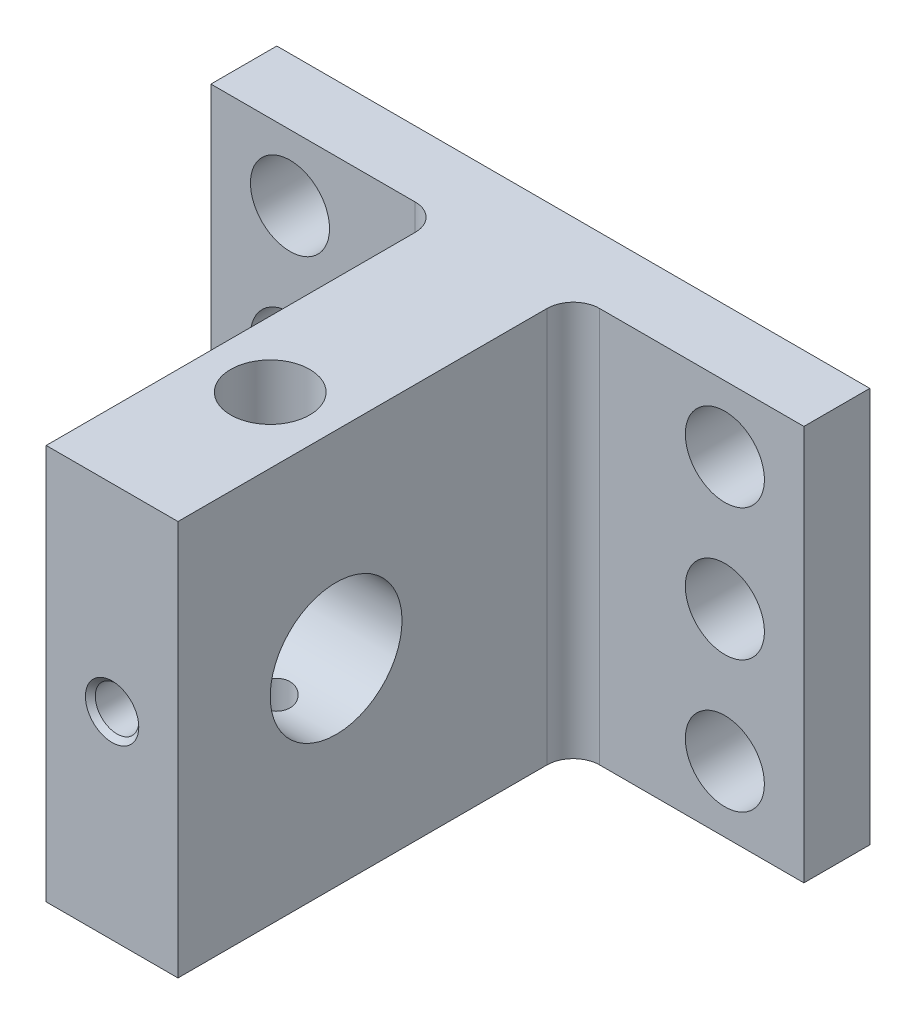
ISO-10303-21;
HEADER;
FILE_DESCRIPTION(('STEP AP214'),'2;1');
FILE_NAME('part.step','',(''),(''),'','','');
FILE_SCHEMA(('AUTOMOTIVE_DESIGN { 1 0 10303 214 1 1 1 1 }'));
ENDSEC;
DATA;
#1=APPLICATION_CONTEXT('core data for automotive mechanical design processes');
#2=APPLICATION_PROTOCOL_DEFINITION('international standard','automotive_design',2000,#1);
#3=PRODUCT_CONTEXT('',#1,'mechanical');
#4=PRODUCT('Part','Part','',(#3));
#5=PRODUCT_RELATED_PRODUCT_CATEGORY('part','',(#4));
#6=PRODUCT_DEFINITION_FORMATION('','',#4);
#7=PRODUCT_DEFINITION_CONTEXT('part definition',#1,'design');
#8=PRODUCT_DEFINITION('design','',#6,#7);
#9=PRODUCT_DEFINITION_SHAPE('','',#8);
#10=(LENGTH_UNIT() NAMED_UNIT(*) SI_UNIT(.MILLI.,.METRE.));
#11=(NAMED_UNIT(*) PLANE_ANGLE_UNIT() SI_UNIT($,.RADIAN.));
#12=(NAMED_UNIT(*) SI_UNIT($,.STERADIAN.) SOLID_ANGLE_UNIT());
#13=UNCERTAINTY_MEASURE_WITH_UNIT(LENGTH_MEASURE(1.E-05),#10,'distance_accuracy_value','');
#14=(GEOMETRIC_REPRESENTATION_CONTEXT(3) GLOBAL_UNCERTAINTY_ASSIGNED_CONTEXT((#13)) GLOBAL_UNIT_ASSIGNED_CONTEXT((#10,
#11,#12)) REPRESENTATION_CONTEXT('',''));
#15=CARTESIAN_POINT('',(0.,0.,0.));
#16=DIRECTION('',(0.,0.,1.));
#17=DIRECTION('',(1.,0.,0.));
#18=AXIS2_PLACEMENT_3D('',#15,#16,#17);
#19=CARTESIAN_POINT('',(7.,15.,7.));
#20=DIRECTION('',(0.,1.,0.));
#21=DIRECTION('',(-1.,0.,0.));
#22=AXIS2_PLACEMENT_3D('',#19,#20,#21);
#23=CYLINDRICAL_SURFACE('',#22,2.);
#24=DIRECTION('',(0.,1.,0.));
#25=VECTOR('',#24,1.);
#26=CARTESIAN_POINT('',(5.,15.,7.));
#27=LINE('',#26,#25);
#28=CARTESIAN_POINT('',(5.,-15.,7.));
#29=VERTEX_POINT('',#28);
#30=CARTESIAN_POINT('',(5.,15.,7.));
#31=VERTEX_POINT('',#30);
#32=EDGE_CURVE('E245',#29,#31,#27,.T.);
#33=ORIENTED_EDGE('',*,*,#32,.F.);
#34=CARTESIAN_POINT('',(7.,-15.,7.));
#35=DIRECTION('',(0.,1.,0.));
#36=DIRECTION('',(0.,0.,1.));
#37=AXIS2_PLACEMENT_3D('',#34,#35,#36);
#38=CIRCLE('',#37,2.);
#39=CARTESIAN_POINT('',(6.99999999999999,-15.,5.));
#40=VERTEX_POINT('',#39);
#41=EDGE_CURVE('E52',#29,#40,#38,.F.);
#42=ORIENTED_EDGE('',*,*,#41,.T.);
#43=DIRECTION('',(0.,1.,0.));
#44=VECTOR('',#43,1.);
#45=CARTESIAN_POINT('',(7.,0.,5.));
#46=LINE('',#45,#44);
#47=CARTESIAN_POINT('',(6.99999999999999,15.,5.));
#48=VERTEX_POINT('',#47);
#49=EDGE_CURVE('E248',#48,#40,#46,.F.);
#50=ORIENTED_EDGE('',*,*,#49,.F.);
#51=CARTESIAN_POINT('',(7.,15.,7.));
#52=DIRECTION('',(0.,-1.,0.));
#53=DIRECTION('',(0.,0.,-1.));
#54=AXIS2_PLACEMENT_3D('',#51,#52,#53);
#55=CIRCLE('',#54,2.);
#56=EDGE_CURVE('E11',#48,#31,#55,.F.);
#57=ORIENTED_EDGE('',*,*,#56,.T.);
#58=EDGE_LOOP('',(#33,#42,#50,#57));
#59=FACE_BOUND('',#58,.T.);
#60=ADVANCED_FACE('F39',(#59),#23,.F.);
#61=CARTESIAN_POINT('',(-7.,15.,7.));
#62=DIRECTION('',(0.,-1.,0.));
#63=DIRECTION('',(1.,0.,0.));
#64=AXIS2_PLACEMENT_3D('',#61,#62,#63);
#65=CYLINDRICAL_SURFACE('',#64,2.);
#66=DIRECTION('',(0.,-1.,0.));
#67=VECTOR('',#66,1.);
#68=CARTESIAN_POINT('',(-5.,15.,7.));
#69=LINE('',#68,#67);
#70=CARTESIAN_POINT('',(-5.,15.,7.));
#71=VERTEX_POINT('',#70);
#72=CARTESIAN_POINT('',(-5.,-15.,7.));
#73=VERTEX_POINT('',#72);
#74=EDGE_CURVE('E143',#71,#73,#69,.T.);
#75=ORIENTED_EDGE('',*,*,#74,.F.);
#76=CARTESIAN_POINT('',(-7.,15.,7.));
#77=DIRECTION('',(0.,-1.,0.));
#78=DIRECTION('',(0.,0.,-1.));
#79=AXIS2_PLACEMENT_3D('',#76,#77,#78);
#80=CIRCLE('',#79,2.);
#81=CARTESIAN_POINT('',(-7.00000000000001,15.,5.));
#82=VERTEX_POINT('',#81);
#83=EDGE_CURVE('E258',#71,#82,#80,.F.);
#84=ORIENTED_EDGE('',*,*,#83,.T.);
#85=DIRECTION('',(0.,-1.,0.));
#86=VECTOR('',#85,1.);
#87=CARTESIAN_POINT('',(-7.,0.,5.));
#88=LINE('',#87,#86);
#89=CARTESIAN_POINT('',(-7.,-15.,5.));
#90=VERTEX_POINT('',#89);
#91=EDGE_CURVE('E262',#90,#82,#88,.F.);
#92=ORIENTED_EDGE('',*,*,#91,.F.);
#93=CARTESIAN_POINT('',(-7.,-15.,7.));
#94=DIRECTION('',(0.,1.,0.));
#95=DIRECTION('',(0.,0.,1.));
#96=AXIS2_PLACEMENT_3D('',#93,#94,#95);
#97=CIRCLE('',#96,2.);
#98=EDGE_CURVE('E249',#90,#73,#97,.F.);
#99=ORIENTED_EDGE('',*,*,#98,.T.);
#100=EDGE_LOOP('',(#75,#84,#92,#99));
#101=FACE_BOUND('',#100,.T.);
#102=ADVANCED_FACE('F238',(#101),#65,.F.);
#103=CARTESIAN_POINT('',(0.,0.,5.));
#104=DIRECTION('',(0.,0.,1.));
#105=DIRECTION('',(1.,0.,0.));
#106=AXIS2_PLACEMENT_3D('',#103,#104,#105);
#107=PLANE('',#106);
#108=CARTESIAN_POINT('',(-16.5,0.,5.));
#109=DIRECTION('',(0.,0.,1.));
#110=DIRECTION('',(1.,0.,0.));
#111=AXIS2_PLACEMENT_3D('',#108,#109,#110);
#112=CIRCLE('',#111,3.);
#113=CARTESIAN_POINT('',(-13.5,0.,5.));
#114=VERTEX_POINT('',#113);
#115=EDGE_CURVE('E327',#114,#114,#112,.T.);
#116=ORIENTED_EDGE('',*,*,#115,.F.);
#117=EDGE_LOOP('',(#116));
#118=FACE_BOUND('',#117,.T.);
#119=CARTESIAN_POINT('',(-16.5,10.,5.));
#120=DIRECTION('',(0.,0.,1.));
#121=DIRECTION('',(1.,0.,0.));
#122=AXIS2_PLACEMENT_3D('',#119,#120,#121);
#123=CIRCLE('',#122,3.);
#124=CARTESIAN_POINT('',(-13.5,10.,5.));
#125=VERTEX_POINT('',#124);
#126=EDGE_CURVE('E333',#125,#125,#123,.T.);
#127=ORIENTED_EDGE('',*,*,#126,.F.);
#128=EDGE_LOOP('',(#127));
#129=FACE_BOUND('',#128,.T.);
#130=CARTESIAN_POINT('',(-16.5,-9.99999999999999,5.));
#131=DIRECTION('',(0.,0.,1.));
#132=DIRECTION('',(-1.,0.,0.));
#133=AXIS2_PLACEMENT_3D('',#130,#131,#132);
#134=CIRCLE('',#133,3.);
#135=CARTESIAN_POINT('',(-19.5,-9.99999999999999,5.));
#136=VERTEX_POINT('',#135);
#137=EDGE_CURVE('E326',#136,#136,#134,.T.);
#138=ORIENTED_EDGE('',*,*,#137,.F.);
#139=EDGE_LOOP('',(#138));
#140=FACE_BOUND('',#139,.T.);
#141=DIRECTION('',(1.,0.,0.));
#142=VECTOR('',#141,1.);
#143=CARTESIAN_POINT('',(-22.5,-15.,5.));
#144=LINE('',#143,#142);
#145=CARTESIAN_POINT('',(-22.5,-15.,5.));
#146=VERTEX_POINT('',#145);
#147=EDGE_CURVE('E158',#146,#90,#144,.T.);
#148=ORIENTED_EDGE('',*,*,#147,.T.);
#149=ORIENTED_EDGE('',*,*,#91,.T.);
#150=DIRECTION('',(-1.,0.,0.));
#151=VECTOR('',#150,1.);
#152=CARTESIAN_POINT('',(-22.5,15.,5.));
#153=LINE('',#152,#151);
#154=CARTESIAN_POINT('',(-22.5,15.,5.));
#155=VERTEX_POINT('',#154);
#156=EDGE_CURVE('E163',#82,#155,#153,.T.);
#157=ORIENTED_EDGE('',*,*,#156,.T.);
#158=DIRECTION('',(0.,-1.,0.));
#159=VECTOR('',#158,1.);
#160=CARTESIAN_POINT('',(-22.5,15.,5.));
#161=LINE('',#160,#159);
#162=EDGE_CURVE('E153',#155,#146,#161,.T.);
#163=ORIENTED_EDGE('',*,*,#162,.T.);
#164=EDGE_LOOP('',(#148,#149,#157,#163));
#165=FACE_BOUND('',#164,.T.);
#166=ADVANCED_FACE('F242',(#118,#129,#140,#165),#107,.T.);
#167=CARTESIAN_POINT('',(-22.5,15.,5.));
#168=DIRECTION('',(1.,0.,0.));
#169=DIRECTION('',(0.,1.,0.));
#170=AXIS2_PLACEMENT_3D('',#167,#168,#169);
#171=PLANE('',#170);
#172=DIRECTION('',(0.,-1.,0.));
#173=VECTOR('',#172,1.);
#174=CARTESIAN_POINT('',(-22.5,15.,0.));
#175=LINE('',#174,#173);
#176=CARTESIAN_POINT('',(-22.5,15.,0.));
#177=VERTEX_POINT('',#176);
#178=CARTESIAN_POINT('',(-22.5,-15.,0.));
#179=VERTEX_POINT('',#178);
#180=EDGE_CURVE('E144',#177,#179,#175,.T.);
#181=ORIENTED_EDGE('',*,*,#180,.T.);
#182=DIRECTION('',(0.,0.,-1.));
#183=VECTOR('',#182,1.);
#184=CARTESIAN_POINT('',(-22.5,-15.,5.));
#185=LINE('',#184,#183);
#186=EDGE_CURVE('E180',#146,#179,#185,.T.);
#187=ORIENTED_EDGE('',*,*,#186,.F.);
#188=ORIENTED_EDGE('',*,*,#162,.F.);
#189=DIRECTION('',(0.,0.,-1.));
#190=VECTOR('',#189,1.);
#191=CARTESIAN_POINT('',(-22.5,15.,5.));
#192=LINE('',#191,#190);
#193=EDGE_CURVE('E166',#155,#177,#192,.T.);
#194=ORIENTED_EDGE('',*,*,#193,.T.);
#195=EDGE_LOOP('',(#181,#187,#188,#194));
#196=FACE_BOUND('',#195,.T.);
#197=ADVANCED_FACE('F283',(#196),#171,.F.);
#198=CARTESIAN_POINT('',(-22.5,-15.,5.));
#199=DIRECTION('',(0.,1.,0.));
#200=DIRECTION('',(0.,0.,1.));
#201=AXIS2_PLACEMENT_3D('',#198,#199,#200);
#202=PLANE('',#201);
#203=CARTESIAN_POINT('',(0.,-15.,23.));
#204=DIRECTION('',(0.,-1.,0.));
#205=DIRECTION('',(0.,0.,-1.));
#206=AXIS2_PLACEMENT_3D('',#203,#204,#205);
#207=CIRCLE('',#206,1.5);
#208=CARTESIAN_POINT('',(0.,-15.,21.5));
#209=VERTEX_POINT('',#208);
#210=EDGE_CURVE('E375',#209,#209,#207,.T.);
#211=ORIENTED_EDGE('',*,*,#210,.F.);
#212=EDGE_LOOP('',(#211));
#213=FACE_BOUND('',#212,.T.);
#214=DIRECTION('',(1.,0.,0.));
#215=VECTOR('',#214,1.);
#216=CARTESIAN_POINT('',(-22.5,-15.,0.));
#217=LINE('',#216,#215);
#218=CARTESIAN_POINT('',(22.5,-15.,0.));
#219=VERTEX_POINT('',#218);
#220=EDGE_CURVE('E147',#179,#219,#217,.T.);
#221=ORIENTED_EDGE('',*,*,#220,.T.);
#222=DIRECTION('',(0.,0.,-1.));
#223=VECTOR('',#222,1.);
#224=CARTESIAN_POINT('',(22.5,-15.,5.));
#225=LINE('',#224,#223);
#226=CARTESIAN_POINT('',(22.5,-15.,5.));
#227=VERTEX_POINT('',#226);
#228=EDGE_CURVE('E177',#227,#219,#225,.T.);
#229=ORIENTED_EDGE('',*,*,#228,.F.);
#230=EDGE_CURVE('E156',#40,#227,#144,.T.);
#231=ORIENTED_EDGE('',*,*,#230,.F.);
#232=ORIENTED_EDGE('',*,*,#41,.F.);
#233=DIRECTION('',(0.,0.,-1.));
#234=VECTOR('',#233,1.);
#235=CARTESIAN_POINT('',(5.,-15.,35.));
#236=LINE('',#235,#234);
#237=CARTESIAN_POINT('',(5.,-15.,35.));
#238=VERTEX_POINT('',#237);
#239=EDGE_CURVE('E125',#238,#29,#236,.T.);
#240=ORIENTED_EDGE('',*,*,#239,.F.);
#241=DIRECTION('',(1.,0.,0.));
#242=VECTOR('',#241,1.);
#243=CARTESIAN_POINT('',(-5.,-15.,35.));
#244=LINE('',#243,#242);
#245=CARTESIAN_POINT('',(-5.,-15.,35.));
#246=VERTEX_POINT('',#245);
#247=EDGE_CURVE('E119',#246,#238,#244,.T.);
#248=ORIENTED_EDGE('',*,*,#247,.F.);
#249=DIRECTION('',(0.,0.,-1.));
#250=VECTOR('',#249,1.);
#251=CARTESIAN_POINT('',(-5.,-15.,35.));
#252=LINE('',#251,#250);
#253=EDGE_CURVE('E123',#246,#73,#252,.T.);
#254=ORIENTED_EDGE('',*,*,#253,.T.);
#255=ORIENTED_EDGE('',*,*,#98,.F.);
#256=ORIENTED_EDGE('',*,*,#147,.F.);
#257=ORIENTED_EDGE('',*,*,#186,.T.);
#258=EDGE_LOOP('',(#221,#229,#231,#232,#240,#248,#254,#255,#256,#257));
#259=FACE_BOUND('',#258,.T.);
#260=ADVANCED_FACE('F121',(#213,#259),#202,.F.);
#261=CARTESIAN_POINT('',(22.5,15.,5.));
#262=DIRECTION('',(-1.,0.,0.));
#263=DIRECTION('',(0.,-1.,0.));
#264=AXIS2_PLACEMENT_3D('',#261,#262,#263);
#265=PLANE('',#264);
#266=DIRECTION('',(0.,1.,0.));
#267=VECTOR('',#266,1.);
#268=CARTESIAN_POINT('',(22.5,15.,0.));
#269=LINE('',#268,#267);
#270=CARTESIAN_POINT('',(22.5,15.,0.));
#271=VERTEX_POINT('',#270);
#272=EDGE_CURVE('E169',#219,#271,#269,.T.);
#273=ORIENTED_EDGE('',*,*,#272,.T.);
#274=DIRECTION('',(0.,0.,-1.));
#275=VECTOR('',#274,1.);
#276=CARTESIAN_POINT('',(22.5,15.,5.));
#277=LINE('',#276,#275);
#278=CARTESIAN_POINT('',(22.5,15.,5.));
#279=VERTEX_POINT('',#278);
#280=EDGE_CURVE('E174',#279,#271,#277,.T.);
#281=ORIENTED_EDGE('',*,*,#280,.F.);
#282=DIRECTION('',(0.,1.,0.));
#283=VECTOR('',#282,1.);
#284=CARTESIAN_POINT('',(22.5,15.,5.));
#285=LINE('',#284,#283);
#286=EDGE_CURVE('E161',#227,#279,#285,.T.);
#287=ORIENTED_EDGE('',*,*,#286,.F.);
#288=ORIENTED_EDGE('',*,*,#228,.T.);
#289=EDGE_LOOP('',(#273,#281,#287,#288));
#290=FACE_BOUND('',#289,.T.);
#291=ADVANCED_FACE('F276',(#290),#265,.F.);
#292=CARTESIAN_POINT('',(-22.5,15.,5.));
#293=DIRECTION('',(0.,-1.,0.));
#294=DIRECTION('',(0.,0.,-1.));
#295=AXIS2_PLACEMENT_3D('',#292,#293,#294);
#296=PLANE('',#295);
#297=CARTESIAN_POINT('',(0.,15.,23.));
#298=DIRECTION('',(0.,1.,0.));
#299=DIRECTION('',(0.,0.,1.));
#300=AXIS2_PLACEMENT_3D('',#297,#298,#299);
#301=CIRCLE('',#300,3.);
#302=CARTESIAN_POINT('',(0.,15.,26.));
#303=VERTEX_POINT('',#302);
#304=EDGE_CURVE('E191',#303,#303,#301,.T.);
#305=ORIENTED_EDGE('',*,*,#304,.F.);
#306=EDGE_LOOP('',(#305));
#307=FACE_BOUND('',#306,.T.);
#308=DIRECTION('',(-1.,0.,0.));
#309=VECTOR('',#308,1.);
#310=CARTESIAN_POINT('',(-22.5,15.,0.));
#311=LINE('',#310,#309);
#312=EDGE_CURVE('E157',#271,#177,#311,.T.);
#313=ORIENTED_EDGE('',*,*,#312,.T.);
#314=ORIENTED_EDGE('',*,*,#193,.F.);
#315=ORIENTED_EDGE('',*,*,#156,.F.);
#316=ORIENTED_EDGE('',*,*,#83,.F.);
#317=DIRECTION('',(0.,0.,-1.));
#318=VECTOR('',#317,1.);
#319=CARTESIAN_POINT('',(-5.,15.,35.));
#320=LINE('',#319,#318);
#321=CARTESIAN_POINT('',(-5.,15.,35.));
#322=VERTEX_POINT('',#321);
#323=EDGE_CURVE('E253',#322,#71,#320,.T.);
#324=ORIENTED_EDGE('',*,*,#323,.F.);
#325=DIRECTION('',(-1.,0.,0.));
#326=VECTOR('',#325,1.);
#327=CARTESIAN_POINT('',(-5.,15.,35.));
#328=LINE('',#327,#326);
#329=CARTESIAN_POINT('',(5.,15.,35.));
#330=VERTEX_POINT('',#329);
#331=EDGE_CURVE('E134',#330,#322,#328,.T.);
#332=ORIENTED_EDGE('',*,*,#331,.F.);
#333=DIRECTION('',(0.,0.,-1.));
#334=VECTOR('',#333,1.);
#335=CARTESIAN_POINT('',(5.,15.,35.));
#336=LINE('',#335,#334);
#337=EDGE_CURVE('E149',#330,#31,#336,.T.);
#338=ORIENTED_EDGE('',*,*,#337,.T.);
#339=ORIENTED_EDGE('',*,*,#56,.F.);
#340=EDGE_CURVE('E164',#279,#48,#153,.T.);
#341=ORIENTED_EDGE('',*,*,#340,.F.);
#342=ORIENTED_EDGE('',*,*,#280,.T.);
#343=EDGE_LOOP('',(#313,#314,#315,#316,#324,#332,#338,#339,#341,#342));
#344=FACE_BOUND('',#343,.T.);
#345=ADVANCED_FACE('F256',(#307,#344),#296,.F.);
#346=CARTESIAN_POINT('',(16.5,-9.99999999999999,5.));
#347=DIRECTION('',(0.,0.,1.));
#348=DIRECTION('',(1.,0.,0.));
#349=AXIS2_PLACEMENT_3D('',#346,#347,#348);
#350=CIRCLE('',#349,3.);
#351=CARTESIAN_POINT('',(19.5,-9.99999999999999,5.));
#352=VERTEX_POINT('',#351);
#353=EDGE_CURVE('E309',#352,#352,#350,.T.);
#354=ORIENTED_EDGE('',*,*,#353,.F.);
#355=EDGE_LOOP('',(#354));
#356=FACE_BOUND('',#355,.T.);
#357=CARTESIAN_POINT('',(16.5,0.,5.));
#358=DIRECTION('',(0.,0.,1.));
#359=DIRECTION('',(-1.,0.,0.));
#360=AXIS2_PLACEMENT_3D('',#357,#358,#359);
#361=CIRCLE('',#360,3.);
#362=CARTESIAN_POINT('',(13.5,0.,5.));
#363=VERTEX_POINT('',#362);
#364=EDGE_CURVE('E313',#363,#363,#361,.T.);
#365=ORIENTED_EDGE('',*,*,#364,.F.);
#366=EDGE_LOOP('',(#365));
#367=FACE_BOUND('',#366,.T.);
#368=CARTESIAN_POINT('',(16.5,10.,5.));
#369=DIRECTION('',(0.,0.,1.));
#370=DIRECTION('',(-1.,0.,0.));
#371=AXIS2_PLACEMENT_3D('',#368,#369,#370);
#372=CIRCLE('',#371,3.);
#373=CARTESIAN_POINT('',(13.5,10.,5.));
#374=VERTEX_POINT('',#373);
#375=EDGE_CURVE('E190',#374,#374,#372,.T.);
#376=ORIENTED_EDGE('',*,*,#375,.F.);
#377=EDGE_LOOP('',(#376));
#378=FACE_BOUND('',#377,.T.);
#379=ORIENTED_EDGE('',*,*,#340,.T.);
#380=ORIENTED_EDGE('',*,*,#49,.T.);
#381=ORIENTED_EDGE('',*,*,#230,.T.);
#382=ORIENTED_EDGE('',*,*,#286,.T.);
#383=EDGE_LOOP('',(#379,#380,#381,#382));
#384=FACE_BOUND('',#383,.T.);
#385=ADVANCED_FACE('F270',(#356,#367,#378,#384),#107,.T.);
#386=CARTESIAN_POINT('',(0.,0.,0.));
#387=DIRECTION('',(0.,0.,1.));
#388=DIRECTION('',(1.,0.,0.));
#389=AXIS2_PLACEMENT_3D('',#386,#387,#388);
#390=PLANE('',#389);
#391=CARTESIAN_POINT('',(-16.5,0.,0.));
#392=DIRECTION('',(0.,0.,1.));
#393=DIRECTION('',(1.,0.,0.));
#394=AXIS2_PLACEMENT_3D('',#391,#392,#393);
#395=CIRCLE('',#394,3.);
#396=CARTESIAN_POINT('',(-13.5,0.,0.));
#397=VERTEX_POINT('',#396);
#398=EDGE_CURVE('E323',#397,#397,#395,.T.);
#399=ORIENTED_EDGE('',*,*,#398,.T.);
#400=EDGE_LOOP('',(#399));
#401=FACE_BOUND('',#400,.T.);
#402=CARTESIAN_POINT('',(-16.5,10.,0.));
#403=DIRECTION('',(0.,0.,1.));
#404=DIRECTION('',(1.,0.,0.));
#405=AXIS2_PLACEMENT_3D('',#402,#403,#404);
#406=CIRCLE('',#405,3.);
#407=CARTESIAN_POINT('',(-13.5,10.,0.));
#408=VERTEX_POINT('',#407);
#409=EDGE_CURVE('E330',#408,#408,#406,.T.);
#410=ORIENTED_EDGE('',*,*,#409,.T.);
#411=EDGE_LOOP('',(#410));
#412=FACE_BOUND('',#411,.T.);
#413=CARTESIAN_POINT('',(16.5,-9.99999999999999,0.));
#414=DIRECTION('',(0.,0.,1.));
#415=DIRECTION('',(1.,0.,0.));
#416=AXIS2_PLACEMENT_3D('',#413,#414,#415);
#417=CIRCLE('',#416,3.);
#418=CARTESIAN_POINT('',(19.5,-9.99999999999999,0.));
#419=VERTEX_POINT('',#418);
#420=EDGE_CURVE('E336',#419,#419,#417,.T.);
#421=ORIENTED_EDGE('',*,*,#420,.T.);
#422=EDGE_LOOP('',(#421));
#423=FACE_BOUND('',#422,.T.);
#424=CARTESIAN_POINT('',(16.5,0.,0.));
#425=DIRECTION('',(0.,0.,1.));
#426=DIRECTION('',(-1.,0.,0.));
#427=AXIS2_PLACEMENT_3D('',#424,#425,#426);
#428=CIRCLE('',#427,3.);
#429=CARTESIAN_POINT('',(13.5,0.,0.));
#430=VERTEX_POINT('',#429);
#431=EDGE_CURVE('E340',#430,#430,#428,.T.);
#432=ORIENTED_EDGE('',*,*,#431,.T.);
#433=EDGE_LOOP('',(#432));
#434=FACE_BOUND('',#433,.T.);
#435=CARTESIAN_POINT('',(16.5,10.,0.));
#436=DIRECTION('',(0.,0.,1.));
#437=DIRECTION('',(-1.,0.,0.));
#438=AXIS2_PLACEMENT_3D('',#435,#436,#437);
#439=CIRCLE('',#438,3.);
#440=CARTESIAN_POINT('',(13.5,10.,0.));
#441=VERTEX_POINT('',#440);
#442=EDGE_CURVE('E317',#441,#441,#439,.T.);
#443=ORIENTED_EDGE('',*,*,#442,.T.);
#444=EDGE_LOOP('',(#443));
#445=FACE_BOUND('',#444,.T.);
#446=CARTESIAN_POINT('',(-16.5,-9.99999999999999,0.));
#447=DIRECTION('',(0.,0.,1.));
#448=DIRECTION('',(-1.,0.,0.));
#449=AXIS2_PLACEMENT_3D('',#446,#447,#448);
#450=CIRCLE('',#449,3.);
#451=CARTESIAN_POINT('',(-19.5,-9.99999999999999,0.));
#452=VERTEX_POINT('',#451);
#453=EDGE_CURVE('E344',#452,#452,#450,.T.);
#454=ORIENTED_EDGE('',*,*,#453,.T.);
#455=EDGE_LOOP('',(#454));
#456=FACE_BOUND('',#455,.T.);
#457=ORIENTED_EDGE('',*,*,#180,.F.);
#458=ORIENTED_EDGE('',*,*,#312,.F.);
#459=ORIENTED_EDGE('',*,*,#272,.F.);
#460=ORIENTED_EDGE('',*,*,#220,.F.);
#461=EDGE_LOOP('',(#457,#458,#459,#460));
#462=FACE_BOUND('',#461,.T.);
#463=ADVANCED_FACE('F280',(#401,#412,#423,#434,#445,#456,#462),#390,.F.);
#464=CARTESIAN_POINT('',(-5.,15.,35.));
#465=DIRECTION('',(1.,0.,0.));
#466=DIRECTION('',(0.,1.,0.));
#467=AXIS2_PLACEMENT_3D('',#464,#465,#466);
#468=PLANE('',#467);
#469=CARTESIAN_POINT('',(-5.,0.,23.));
#470=DIRECTION('',(-1.,0.,0.));
#471=DIRECTION('',(0.,-1.,0.));
#472=AXIS2_PLACEMENT_3D('',#469,#470,#471);
#473=CIRCLE('',#472,5.);
#474=CARTESIAN_POINT('',(-5.,-5.,23.));
#475=VERTEX_POINT('',#474);
#476=EDGE_CURVE('E347',#475,#475,#473,.T.);
#477=ORIENTED_EDGE('',*,*,#476,.F.);
#478=EDGE_LOOP('',(#477));
#479=FACE_BOUND('',#478,.T.);
#480=ORIENTED_EDGE('',*,*,#323,.T.);
#481=ORIENTED_EDGE('',*,*,#74,.T.);
#482=ORIENTED_EDGE('',*,*,#253,.F.);
#483=DIRECTION('',(0.,-1.,0.));
#484=VECTOR('',#483,1.);
#485=CARTESIAN_POINT('',(-5.,15.,35.));
#486=LINE('',#485,#484);
#487=EDGE_CURVE('E129',#322,#246,#486,.T.);
#488=ORIENTED_EDGE('',*,*,#487,.F.);
#489=EDGE_LOOP('',(#480,#481,#482,#488));
#490=FACE_BOUND('',#489,.T.);
#491=ADVANCED_FACE('F141',(#479,#490),#468,.F.);
#492=CARTESIAN_POINT('',(5.,15.,35.));
#493=DIRECTION('',(-1.,0.,0.));
#494=DIRECTION('',(0.,-1.,0.));
#495=AXIS2_PLACEMENT_3D('',#492,#493,#494);
#496=PLANE('',#495);
#497=CARTESIAN_POINT('',(5.,0.,23.));
#498=DIRECTION('',(-1.,0.,0.));
#499=DIRECTION('',(0.,-1.,0.));
#500=AXIS2_PLACEMENT_3D('',#497,#498,#499);
#501=CIRCLE('',#500,5.);
#502=CARTESIAN_POINT('',(5.,-5.,23.));
#503=VERTEX_POINT('',#502);
#504=EDGE_CURVE('E138',#503,#503,#501,.T.);
#505=ORIENTED_EDGE('',*,*,#504,.T.);
#506=EDGE_LOOP('',(#505));
#507=FACE_BOUND('',#506,.T.);
#508=ORIENTED_EDGE('',*,*,#239,.T.);
#509=ORIENTED_EDGE('',*,*,#32,.T.);
#510=ORIENTED_EDGE('',*,*,#337,.F.);
#511=DIRECTION('',(0.,1.,0.));
#512=VECTOR('',#511,1.);
#513=CARTESIAN_POINT('',(5.,15.,35.));
#514=LINE('',#513,#512);
#515=EDGE_CURVE('E128',#238,#330,#514,.T.);
#516=ORIENTED_EDGE('',*,*,#515,.F.);
#517=EDGE_LOOP('',(#508,#509,#510,#516));
#518=FACE_BOUND('',#517,.T.);
#519=ADVANCED_FACE('F251',(#507,#518),#496,.F.);
#520=CARTESIAN_POINT('',(0.,0.,35.));
#521=DIRECTION('',(0.,0.,1.));
#522=DIRECTION('',(1.,0.,0.));
#523=AXIS2_PLACEMENT_3D('',#520,#521,#522);
#524=PLANE('',#523);
#525=CARTESIAN_POINT('',(0.,0.,35.));
#526=DIRECTION('',(0.,0.,1.));
#527=DIRECTION('',(1.,0.,0.));
#528=AXIS2_PLACEMENT_3D('',#525,#526,#527);
#529=CIRCLE('',#528,2.025);
#530=CARTESIAN_POINT('',(2.025,0.,35.));
#531=VERTEX_POINT('',#530);
#532=EDGE_CURVE('E368',#531,#531,#529,.T.);
#533=ORIENTED_EDGE('',*,*,#532,.F.);
#534=EDGE_LOOP('',(#533));
#535=FACE_BOUND('',#534,.T.);
#536=ORIENTED_EDGE('',*,*,#487,.T.);
#537=ORIENTED_EDGE('',*,*,#247,.T.);
#538=ORIENTED_EDGE('',*,*,#515,.T.);
#539=ORIENTED_EDGE('',*,*,#331,.T.);
#540=EDGE_LOOP('',(#536,#537,#538,#539));
#541=FACE_BOUND('',#540,.T.);
#542=ADVANCED_FACE('F132',(#535,#541),#524,.T.);
#543=CARTESIAN_POINT('',(5.,0.,23.));
#544=DIRECTION('',(-1.,0.,0.));
#545=DIRECTION('',(0.,-1.,0.));
#546=AXIS2_PLACEMENT_3D('',#543,#544,#545);
#547=CYLINDRICAL_SURFACE('',#546,5.);
#548=CARTESIAN_POINT('',(1.64999999999999,0.,28.));
#549=CARTESIAN_POINT('',(1.65000024251438,0.0900803323989864,28.0000001256488));
#550=CARTESIAN_POINT('',(1.64259916251504,0.180159574077353,27.9975431261787));
#551=CARTESIAN_POINT('',(1.61327885047236,0.357667875169256,27.9879834817115));
#552=CARTESIAN_POINT('',(1.59135782416471,0.445096605656318,27.9808802625713));
#553=CARTESIAN_POINT('',(1.5338286876117,0.614719075952391,27.962800681432));
#554=CARTESIAN_POINT('',(1.49824318298596,0.696921201899962,27.9518307187668));
#555=CARTESIAN_POINT('',(1.41449642730814,0.854190645874479,27.9271394724884));
#556=CARTESIAN_POINT('',(1.36633277369657,0.929256597076049,27.9134176633597));
#557=CARTESIAN_POINT('',(1.25707517692859,1.07267700256013,27.8841466797601));
#558=CARTESIAN_POINT('',(1.19562998172583,1.140755021368,27.8685543688659));
#559=CARTESIAN_POINT('',(1.06230048608016,1.26585047260416,27.8375390780401));
#560=CARTESIAN_POINT('',(0.99041395330728,1.32286553369749,27.8221161350793));
#561=CARTESIAN_POINT('',(0.835769387620545,1.42578155512386,27.7927131317333));
#562=CARTESIAN_POINT('',(0.752762762414833,1.47132547146368,27.7787857489883));
#563=CARTESIAN_POINT('',(0.579734369165918,1.5476895000705,27.7546054948377));
#564=CARTESIAN_POINT('',(0.489714702647665,1.57851400356115,27.744351527775));
#565=CARTESIAN_POINT('',(0.308355170918736,1.62353134991423,27.729132826351));
#566=CARTESIAN_POINT('',(0.217157836674353,1.63824134173319,27.7240041223577));
#567=CARTESIAN_POINT('',(0.0334563873059885,1.65222861163855,27.7191313464795));
#568=CARTESIAN_POINT('',(-0.0590473250677409,1.65151054662634,27.7193856497537));
#569=CARTESIAN_POINT('',(-0.238347202392312,1.63506410098718,27.7251062910757));
#570=CARTESIAN_POINT('',(-0.325213735238811,1.62000769651631,27.7303392887968));
#571=CARTESIAN_POINT('',(-0.495110906166725,1.57640708934976,27.7450463252349));
#572=CARTESIAN_POINT('',(-0.578141092265253,1.54786130181505,27.7545208622744));
#573=CARTESIAN_POINT('',(-0.739547439994631,1.47764674240872,27.77681173941));
#574=CARTESIAN_POINT('',(-0.817828850225317,1.43577693123635,27.7896787194768));
#575=CARTESIAN_POINT('',(-0.966468362301515,1.34024242388314,27.8172831591603));
#576=CARTESIAN_POINT('',(-1.03682420369405,1.28657437554157,27.8320211498719));
#577=CARTESIAN_POINT('',(-1.1713952274102,1.16572801734403,27.8626279824257));
#578=CARTESIAN_POINT('',(-1.23511287864314,1.09799945388895,27.8785161259402));
#579=CARTESIAN_POINT('',(-1.35041417823919,0.952622363558083,27.9089733458653));
#580=CARTESIAN_POINT('',(-1.40199670875498,0.874972923819715,27.9235423006806));
#581=CARTESIAN_POINT('',(-1.49195351683701,0.710918878360192,27.9499042925994));
#582=CARTESIAN_POINT('',(-1.53019689721304,0.624437715003004,27.9616694793611));
#583=CARTESIAN_POINT('',(-1.59143971960629,0.445788820584334,27.9808963451473));
#584=CARTESIAN_POINT('',(-1.61444434706412,0.353623035566633,27.9883594879583));
#585=CARTESIAN_POINT('',(-1.64368078538325,0.170434936942809,27.9979000192954));
#586=CARTESIAN_POINT('',(-1.65058509363945,0.0795310449403307,28.0001932084094));
#587=CARTESIAN_POINT('',(-1.64933736730873,-0.102152997074191,27.9997812039932));
#588=CARTESIAN_POINT('',(-1.64118781713323,-0.19293316503069,27.9970768352343));
#589=CARTESIAN_POINT('',(-1.61059717381708,-0.369117276094975,27.9871159289082));
#590=CARTESIAN_POINT('',(-1.58856678998546,-0.454600657078432,27.9799902980649));
#591=CARTESIAN_POINT('',(-1.53135130848824,-0.620625393385985,27.9620361021664));
#592=CARTESIAN_POINT('',(-1.49616454011809,-0.701166119538829,27.9512070668376));
#593=CARTESIAN_POINT('',(-1.41261898044763,-0.857353583850652,27.9265973819026));
#594=CARTESIAN_POINT('',(-1.3639413852355,-0.932818538636804,27.9127472859948));
#595=CARTESIAN_POINT('',(-1.25517176520408,-1.07472879779132,27.8836680633903));
#596=CARTESIAN_POINT('',(-1.19507631632603,-1.14117138619963,27.8684385237358));
#597=CARTESIAN_POINT('',(-1.06201382730804,-1.26622547851876,27.8374590984749));
#598=CARTESIAN_POINT('',(-0.988593133076294,-1.32435715949935,27.8217162016));
#599=CARTESIAN_POINT('',(-0.83270014510631,-1.42753142742357,27.7921856704663));
#600=CARTESIAN_POINT('',(-0.750227816840755,-1.47257396443645,27.7783980436663));
#601=CARTESIAN_POINT('',(-0.578574516041663,-1.54806908435207,27.7544774687033));
#602=CARTESIAN_POINT('',(-0.48941001402278,-1.57855621066784,27.7443358819136));
#603=CARTESIAN_POINT('',(-0.306802097920403,-1.62395003915295,27.728992662468));
#604=CARTESIAN_POINT('',(-0.213360579787972,-1.63886357641239,27.7237888627591));
#605=CARTESIAN_POINT('',(-0.0299145750870896,-1.65216049477083,27.7191535274486));
#606=CARTESIAN_POINT('',(0.0600259363781688,-1.6513387236508,27.7194444241787));
#607=CARTESIAN_POINT('',(0.238416599590153,-1.63513842564512,27.7250813949056));
#608=CARTESIAN_POINT('',(0.326866836415119,-1.61976073262755,27.7304271793221));
#609=CARTESIAN_POINT('',(0.498164137184587,-1.57544291875231,27.7453669376446));
#610=CARTESIAN_POINT('',(0.581083972157467,-1.54675527092969,27.7548816528936));
#611=CARTESIAN_POINT('',(0.740997492662573,-1.47683540940045,27.7770593561513));
#612=CARTESIAN_POINT('',(0.817989874951902,-1.43560044678476,27.7897230339343));
#613=CARTESIAN_POINT('',(0.967443454366381,-1.33969084183065,27.8174493934876));
#614=CARTESIAN_POINT('',(1.03956841106976,-1.28451538865981,27.8325917044349));
#615=CARTESIAN_POINT('',(1.17379258067501,-1.16314331347536,27.8632304306306));
#616=CARTESIAN_POINT('',(1.23588897512673,-1.09694360376002,27.878726944033));
#617=CARTESIAN_POINT('',(1.35066333180925,-0.952387676734102,27.9090331754877));
#618=CARTESIAN_POINT('',(1.40289502168524,-0.873665758138166,27.9237945891133));
#619=CARTESIAN_POINT('',(1.49332485789775,-0.708077082051265,27.950317502488));
#620=CARTESIAN_POINT('',(1.53152691711137,-0.621212604024476,27.9620798384025));
#621=CARTESIAN_POINT('',(1.59101301503052,-0.44638654187221,27.9807695303246));
#622=CARTESIAN_POINT('',(1.61306352248397,-0.358709155083949,27.9879137176321));
#623=CARTESIAN_POINT('',(1.64255497204319,-0.180687007883426,27.9975282748082));
#624=CARTESIAN_POINT('',(1.64999975677856,-0.0903429553968467,27.9999998739849));
#625=CARTESIAN_POINT('',(1.64999999999999,0.,28.));
#626=B_SPLINE_CURVE_WITH_KNOTS('',3,(#548,#549,#550,#551,#552,#553,#554,#555,#556,#557,#558,
#559,#560,#561,#562,#563,#564,#565,#566,#567,#568,#569,#570,#571,#572,#573,#574,#575,#576,#577,
#578,#579,#580,#581,#582,#583,#584,#585,#586,#587,#588,#589,#590,#591,#592,#593,#594,#595,#596,
#597,#598,#599,#600,#601,#602,#603,#604,#605,#606,#607,#608,#609,#610,#611,#612,#613,#614,#615,
#616,#617,#618,#619,#620,#621,#622,#623,#624,#625),.UNSPECIFIED.,.T.,.F.,(4,2,2,2,2,2,2,2,2,2,2,
2,2,2,2,2,2,2,2,2,2,2,2,2,2,2,2,2,2,2,2,2,2,2,2,2,2,2,4),(0.,0.269908604132499,
0.539850567737244,0.809347867689089,1.07889668217443,1.3567121576595,1.63458711701567,
1.92026489148116,2.20585738673401,2.48198869358465,2.75803665240171,3.02175295330502,
3.2855002453837,3.55343249441284,3.82144096800202,4.10314526837292,4.38487550826384,
4.66929734218005,4.95362234329171,5.22584041060143,5.49801355645389,5.76248915124944,
6.02699834271651,6.29838751507401,6.56985820217364,6.8534047271815,7.13695233381082,
7.41982362841782,7.70257072144067,7.97107468624604,8.2395632701409,8.50315503612405,
8.76680459233086,9.04176838412556,9.31680931840232,9.60227659952692,9.88766420298739,
10.1584309528124,10.4291264568694),.UNSPECIFIED.);
#627=CARTESIAN_POINT('',(1.64999999999999,0.,28.));
#628=VERTEX_POINT('',#627);
#629=EDGE_CURVE('E42',#628,#628,#626,.T.);
#630=ORIENTED_EDGE('',*,*,#629,.T.);
#631=EDGE_LOOP('',(#630));
#632=FACE_BOUND('',#631,.T.);
#633=CARTESIAN_POINT('',(1.5,-5.,23.));
#634=CARTESIAN_POINT('',(1.49999900251512,-4.99999929250549,23.0822886127533));
#635=CARTESIAN_POINT('',(1.49320613637603,-4.99794915693953,23.1645873183515));
#636=CARTESIAN_POINT('',(1.4662786457779,-4.98997105593691,23.3267881253049));
#637=CARTESIAN_POINT('',(1.44614004197666,-4.98404193389692,23.4066895044114));
#638=CARTESIAN_POINT('',(1.39325398308974,-4.96895552501836,23.5617327077545));
#639=CARTESIAN_POINT('',(1.36052513038106,-4.95980300250425,23.6368813643954));
#640=CARTESIAN_POINT('',(1.28346390694417,-4.93922109237645,23.7806241810531));
#641=CARTESIAN_POINT('',(1.23912999260458,-4.92779140192066,23.8492174674697));
#642=CARTESIAN_POINT('',(1.13877599252733,-4.90350737192774,23.9798717971837));
#643=CARTESIAN_POINT('',(1.08248337411409,-4.89062383657036,24.0417180712443));
#644=CARTESIAN_POINT('',(0.960390770089818,-4.86505834210442,24.1552492092332));
#645=CARTESIAN_POINT('',(0.894589187875042,-4.85237641724501,24.2069323632744));
#646=CARTESIAN_POINT('',(0.753529246962388,-4.82834113993772,24.2998003772371));
#647=CARTESIAN_POINT('',(0.678091539009262,-4.81702406663874,24.3407230902221));
#648=CARTESIAN_POINT('',(0.521010745769707,-4.79743620394031,24.4092139477476));
#649=CARTESIAN_POINT('',(0.439369156072024,-4.7891646831331,24.4367852991997));
#650=CARTESIAN_POINT('',(0.27460973386954,-4.77690870838434,24.4770163368265));
#651=CARTESIAN_POINT('',(0.191597256136056,-4.77281069324533,24.4900719623468));
#652=CARTESIAN_POINT('',(0.0244668437832333,-4.76902789749767,24.5021373061467));
#653=CARTESIAN_POINT('',(-0.0596508180590885,-4.76934204760571,24.5011504276108));
#654=CARTESIAN_POINT('',(-0.223383908608485,-4.77424744067777,24.4854697719981));
#655=CARTESIAN_POINT('',(-0.30305225036224,-4.7786838859914,24.4712720526269));
#656=CARTESIAN_POINT('',(-0.458819786273461,-4.79108356228624,24.4303742042706));
#657=CARTESIAN_POINT('',(-0.534918627374334,-4.7990471413235,24.4036728414164));
#658=CARTESIAN_POINT('',(-0.68260034966074,-4.81772733074973,24.3381602665368));
#659=CARTESIAN_POINT('',(-0.754107083955262,-4.82848016115952,24.2991881693464));
#660=CARTESIAN_POINT('',(-0.889732022010192,-4.85150987000064,24.2103522258868));
#661=CARTESIAN_POINT('',(-0.953848429413778,-4.86378711746991,24.1604857400259));
#662=CARTESIAN_POINT('',(-1.07568619076202,-4.88911011297937,24.0488129076555));
#663=CARTESIAN_POINT('',(-1.13302866402967,-4.90216654310498,23.986594907467));
#664=CARTESIAN_POINT('',(-1.23655398406425,-4.92712244063258,23.853263259314));
#665=CARTESIAN_POINT('',(-1.28273612841443,-4.9390218351841,23.7821490518609));
#666=CARTESIAN_POINT('',(-1.36285992246473,-4.9604316006947,23.6323550383428));
#667=CARTESIAN_POINT('',(-1.39671751624986,-4.96992543668314,23.5536277497479));
#668=CARTESIAN_POINT('',(-1.45059959009963,-4.98533521832222,23.3912454156035));
#669=CARTESIAN_POINT('',(-1.47062792853249,-4.99125216186999,23.3075917515896));
#670=CARTESIAN_POINT('',(-1.4956521778994,-4.99868364643538,23.1409522426683));
#671=CARTESIAN_POINT('',(-1.50116158580161,-5.0003485041779,23.0580500976012));
#672=CARTESIAN_POINT('',(-1.49843084428792,-4.99952923241759,22.8925003941766));
#673=CARTESIAN_POINT('',(-1.49019253034856,-4.99704565677756,22.8098528033092));
#674=CARTESIAN_POINT('',(-1.46061538888851,-4.98830696987163,22.6490963946903));
#675=CARTESIAN_POINT('',(-1.43957661241913,-4.98213829799416,22.5709272273858));
#676=CARTESIAN_POINT('',(-1.3853567672218,-4.96674347841532,22.4192453610455));
#677=CARTESIAN_POINT('',(-1.35217423896214,-4.95751696321084,22.3457332229744));
#678=CARTESIAN_POINT('',(-1.27374683451887,-4.93669654351324,22.2035628105389));
#679=CARTESIAN_POINT('',(-1.22824065905203,-4.92505280829675,22.1350561738003));
#680=CARTESIAN_POINT('',(-1.12677524594719,-4.90073468764317,22.0064766920198));
#681=CARTESIAN_POINT('',(-1.07081338811233,-4.8880600443108,21.9464059676441));
#682=CARTESIAN_POINT('',(-0.947612691630655,-4.86253171869138,21.8341425544897));
#683=CARTESIAN_POINT('',(-0.880038124228265,-4.84968825033267,21.782315187685));
#684=CARTESIAN_POINT('',(-0.73687206098647,-4.82576515238463,21.6907100492785));
#685=CARTESIAN_POINT('',(-0.661280775441787,-4.81468547654651,21.6509319617053));
#686=CARTESIAN_POINT('',(-0.504467508745312,-4.79567189615055,21.5848265287283));
#687=CARTESIAN_POINT('',(-0.423273813463409,-4.78772337843827,21.5584365306295));
#688=CARTESIAN_POINT('',(-0.257312031068522,-4.77591594362794,21.5197826918489));
#689=CARTESIAN_POINT('',(-0.172545179212331,-4.772055625083,21.5075140102122));
#690=CARTESIAN_POINT('',(-0.00563848162377213,-4.76899972496087,21.4977801551494));
#691=CARTESIAN_POINT('',(0.0764636510175864,-4.76961647442754,21.4997194469151));
#692=CARTESIAN_POINT('',(0.239114103372801,-4.77499401288294,21.5169249455519));
#693=CARTESIAN_POINT('',(0.319662485176354,-4.77975463592551,21.5321906187528));
#694=CARTESIAN_POINT('',(0.475945399142853,-4.79275763670385,21.5752311119586));
#695=CARTESIAN_POINT('',(0.551727287361695,-4.80095604545964,21.6028482449293));
#696=CARTESIAN_POINT('',(0.697642438817724,-4.81990278909136,21.6696849287887));
#697=CARTESIAN_POINT('',(0.767774617640757,-4.83065161194312,21.7089067003712));
#698=CARTESIAN_POINT('',(0.903163116527113,-4.85397676425833,21.7995123619493));
#699=CARTESIAN_POINT('',(0.968148761260413,-4.86660540163797,21.8512872390701));
#700=CARTESIAN_POINT('',(1.08870249830787,-4.89201320450026,21.9648256537022));
#701=CARTESIAN_POINT('',(1.14426813946776,-4.90479240823905,22.0265917828655));
#702=CARTESIAN_POINT('',(1.24602341229503,-4.92950936570649,22.1605342378167));
#703=CARTESIAN_POINT('',(1.29189144685549,-4.94141159765674,22.2329621142094));
#704=CARTESIAN_POINT('',(1.37073516990403,-4.96260680455813,22.3848586260165));
#705=CARTESIAN_POINT('',(1.40371688827451,-4.97190099931066,22.464323947001));
#706=CARTESIAN_POINT('',(1.45289527565275,-4.98602174969301,22.6192422873447));
#707=CARTESIAN_POINT('',(1.47051167288325,-4.99122027381067,22.6942130380458));
#708=CARTESIAN_POINT('',(1.49406352524158,-4.99820944494492,22.8461198047692));
#709=CARTESIAN_POINT('',(1.50000093270482,-5.0000006615474,22.9230554901419));
#710=CARTESIAN_POINT('',(1.5,-5.,23.));
#711=B_SPLINE_CURVE_WITH_KNOTS('',3,(#633,#634,#635,#636,#637,#638,#639,#640,#641,#642,#643,
#644,#645,#646,#647,#648,#649,#650,#651,#652,#653,#654,#655,#656,#657,#658,#659,#660,#661,#662,
#663,#664,#665,#666,#667,#668,#669,#670,#671,#672,#673,#674,#675,#676,#677,#678,#679,#680,#681,
#682,#683,#684,#685,#686,#687,#688,#689,#690,#691,#692,#693,#694,#695,#696,#697,#698,#699,#700,
#701,#702,#703,#704,#705,#706,#707,#708,#709,#710),.UNSPECIFIED.,.T.,.F.,(4,2,2,2,2,2,2,2,2,2,2,
2,2,2,2,2,2,2,2,2,2,2,2,2,2,2,2,2,2,2,2,2,2,2,2,2,2,2,4),(0.,0.246583203612611,
0.493239964846001,0.739533676300876,0.985860164412698,1.23855602948191,1.49129437288633,
1.74971481004109,2.00807314543224,2.25919689356599,2.5102597831909,2.75226016697676,
2.99428443658001,3.2396242644712,3.48502360158556,3.74067104048167,3.99633456531072,
4.25371046881689,4.51101453528808,4.75908809438545,5.00712853550327,5.24956746682328,
5.49203554593729,5.74011305702909,5.98825282000191,6.24540400322819,6.50254844252681,
6.75847814951252,7.01432009460283,7.25950155466943,7.504673196616,7.74680040402722,
7.98897397553108,8.23996925679931,8.49102974897503,8.74942996156671,9.00770911595236,
9.2383169193046,9.46888616948875),.UNSPECIFIED.);
#712=CARTESIAN_POINT('',(1.5,-5.,23.));
#713=VERTEX_POINT('',#712);
#714=EDGE_CURVE('E192',#713,#713,#711,.T.);
#715=ORIENTED_EDGE('',*,*,#714,.T.);
#716=EDGE_LOOP('',(#715));
#717=FACE_BOUND('',#716,.T.);
#718=CARTESIAN_POINT('',(0.,4.,26.));
#719=CARTESIAN_POINT('',(0.0754616103656618,3.99999997094658,25.9999999059924));
#720=CARTESIAN_POINT('',(0.150919951825706,4.00214560778386,25.997146600745));
#721=CARTESIAN_POINT('',(0.301183579155876,4.01061905841259,25.9857960202383));
#722=CARTESIAN_POINT('',(0.37598860368072,4.01694847458097,25.9772965825183));
#723=CARTESIAN_POINT('',(0.598542400800124,4.04185988554313,25.94350195877));
#724=CARTESIAN_POINT('',(0.744466163038648,4.06636523363867,25.9099103679258));
#725=CARTESIAN_POINT('',(1.02619529387302,4.12724466313279,25.8228688806433));
#726=CARTESIAN_POINT('',(1.16206540972156,4.16353284212726,25.7695623358124));
#727=CARTESIAN_POINT('',(1.42286717142596,4.24371857831162,25.645058939393));
#728=CARTESIAN_POINT('',(1.54779553947815,4.28761840405593,25.5738567513836));
#729=CARTESIAN_POINT('',(1.79990131024536,4.3845721143975,25.4054234193106));
#730=CARTESIAN_POINT('',(1.92548608074574,4.43808896832273,25.3060741998394));
#731=CARTESIAN_POINT('',(2.15952535636891,4.54452303763808,25.088545421592));
#732=CARTESIAN_POINT('',(2.26796690142325,4.59743977155758,24.9703517509353));
#733=CARTESIAN_POINT('',(2.47628246871424,4.70351798165428,24.7028457804227));
#734=CARTESIAN_POINT('',(2.57396641364106,4.75608869625048,24.551551293099));
#735=CARTESIAN_POINT('',(2.69974650858797,4.82570563669468,24.3113243043916));
#736=CARTESIAN_POINT('',(2.73822411545811,4.84737661360986,24.229007367826));
#737=CARTESIAN_POINT('',(2.80779096487914,4.88701002756048,24.0604722129963));
#738=CARTESIAN_POINT('',(2.83888509171157,4.90497491519086,23.9742566189468));
#739=CARTESIAN_POINT('',(2.89062746245329,4.9351119388654,23.8069680266714));
#740=CARTESIAN_POINT('',(2.9119872715291,4.94767216447126,23.7261841587402));
#741=CARTESIAN_POINT('',(2.94794996135096,4.96892323787741,23.5626663487444));
#742=CARTESIAN_POINT('',(2.9625566076376,4.97761624192487,23.4799335205276));
#743=CARTESIAN_POINT('',(2.98478468451609,4.99087754875312,23.3132446212674));
#744=CARTESIAN_POINT('',(2.9924098423118,4.99544805239181,23.2292892272654));
#745=CARTESIAN_POINT('',(3.00056663984718,5.00033941607428,23.0609397888852));
#746=CARTESIAN_POINT('',(3.00109900129356,5.00066070848407,22.9765457900102));
#747=CARTESIAN_POINT('',(2.99275721772026,4.99565270087357,22.7448288163536));
#748=CARTESIAN_POINT('',(2.97652885035085,4.98590479614142,22.5977800427328));
#749=CARTESIAN_POINT('',(2.92304450631758,4.95416390550291,22.3090437511816));
#750=CARTESIAN_POINT('',(2.8857869733895,4.9321700133334,22.1673566308687));
#751=CARTESIAN_POINT('',(2.79166776699805,4.87769707511974,21.8918939293081));
#752=CARTESIAN_POINT('',(2.73469357980008,4.84515792140775,21.7581690327734));
#753=CARTESIAN_POINT('',(2.6032310655483,4.77219304045845,21.5020206643965));
#754=CARTESIAN_POINT('',(2.52873818986414,4.73176526544935,21.3796001391876));
#755=CARTESIAN_POINT('',(2.35432172038148,4.64075842839173,21.1338521020075));
#756=CARTESIAN_POINT('',(2.2524233514645,4.58954363323803,21.0121628451924));
#757=CARTESIAN_POINT('',(2.03119178989514,4.48511110796774,20.7865705107683));
#758=CARTESIAN_POINT('',(1.91183500028095,4.4318907405416,20.6826919256589));
#759=CARTESIAN_POINT('',(1.64269317960225,4.32222149525339,20.4835032984067));
#760=CARTESIAN_POINT('',(1.4909848446704,4.26611322583746,20.3905813507241));
#761=CARTESIAN_POINT('',(1.17058753897334,4.16501759300692,20.2320556416455));
#762=CARTESIAN_POINT('',(1.00193056868576,4.12000980621702,20.1664015564863));
#763=CARTESIAN_POINT('',(0.695212735504373,4.05791730375361,20.0784500619156));
#764=CARTESIAN_POINT('',(0.559918734207669,4.03667777278559,20.0494419368152));
#765=CARTESIAN_POINT('',(0.285252780598739,4.00784301513237,20.0103825418294));
#766=CARTESIAN_POINT('',(0.145885763115495,4.00023192044755,20.0003092248945));
#767=CARTESIAN_POINT('',(-0.133103368961634,3.9997782882838,19.9997043867762));
#768=CARTESIAN_POINT('',(-0.272725569601716,4.00695621149423,20.0091999392381));
#769=CARTESIAN_POINT('',(-0.547974672313769,4.03503040875294,20.0471941552837));
#770=CARTESIAN_POINT('',(-0.683598327819906,4.05593752603304,20.0757078395489));
#771=CARTESIAN_POINT('',(-0.947429215549476,4.1086353928605,20.1502338713207));
#772=CARTESIAN_POINT('',(-1.07564548413755,4.14041253958232,20.1962243561851));
#773=CARTESIAN_POINT('',(-1.32295522030752,4.21143069058873,20.304074317352));
#774=CARTESIAN_POINT('',(-1.4420452245939,4.25067450889245,20.3659397796483));
#775=CARTESIAN_POINT('',(-1.6904810952463,4.34073681424693,20.5166532419614));
#776=CARTESIAN_POINT('',(-1.81780543232944,4.39236652981539,20.608354961473));
#777=CARTESIAN_POINT('',(-2.05656720394541,4.49643335252963,20.8102438590411));
#778=CARTESIAN_POINT('',(-2.16798924609444,4.54887118822612,20.9204487254287));
#779=CARTESIAN_POINT('',(-2.38646399131575,4.65671991538654,21.1734852447168));
#780=CARTESIAN_POINT('',(-2.49106470576289,4.71163080343121,21.3186960297997));
#781=CARTESIAN_POINT('',(-2.62815449772339,4.78599458202111,21.5505536872149));
#782=CARTESIAN_POINT('',(-2.67056200213691,4.80945640676866,21.6302139428835));
#783=CARTESIAN_POINT('',(-2.74830388347849,4.85305400686526,21.7937634383767));
#784=CARTESIAN_POINT('',(-2.7836427131187,4.87319187464059,21.8776499740143));
#785=CARTESIAN_POINT('',(-2.84447964323443,4.9082066725368,22.0428593012251));
#786=CARTESIAN_POINT('',(-2.87050371846179,4.9233583127873,22.123930532662));
#787=CARTESIAN_POINT('',(-2.91566498160908,4.94982497459131,22.2885393800187));
#788=CARTESIAN_POINT('',(-2.93480602887991,4.96114214594589,22.3720755852912));
#789=CARTESIAN_POINT('',(-2.9659003097131,4.9795990393125,22.5408803849177));
#790=CARTESIAN_POINT('',(-2.97785843736055,4.98674160560362,22.626147758696));
#791=CARTESIAN_POINT('',(-2.99440676165901,4.99664216975594,22.7976158408365));
#792=CARTESIAN_POINT('',(-2.99899791878895,4.99940073918632,22.8838164260546));
#793=CARTESIAN_POINT('',(-3.00132828975941,5.00079353601933,23.1195193840806));
#794=CARTESIAN_POINT('',(-2.9916010745741,4.9949361975757,23.2692131349716));
#795=CARTESIAN_POINT('',(-2.95021794585106,4.97026391444784,23.5643255444776));
#796=CARTESIAN_POINT('',(-2.91856178805991,4.95144882543496,23.7097441554555));
#797=CARTESIAN_POINT('',(-2.83555942935372,4.90298726022976,23.9902836174303));
#798=CARTESIAN_POINT('',(-2.784536560451,4.87351900635896,24.1255320564868));
#799=CARTESIAN_POINT('',(-2.66471905823652,4.8060670798365,24.3855659531815));
#800=CARTESIAN_POINT('',(-2.59592043965644,4.76808149787884,24.510349056203));
#801=CARTESIAN_POINT('',(-2.43415009310425,4.68186861678971,24.7605265281201));
#802=CARTESIAN_POINT('',(-2.33936493647195,4.63297714592576,24.884516634541));
#803=CARTESIAN_POINT('',(-2.13249157543451,4.5320378935883,25.1157957778969));
#804=CARTESIAN_POINT('',(-2.02038420233561,4.47998665474642,25.2230660453146));
#805=CARTESIAN_POINT('',(-1.76543895662126,4.37056449731607,25.4318169985264));
#806=CARTESIAN_POINT('',(-1.62050691551091,4.31335603990193,25.5308384117981));
#807=CARTESIAN_POINT('',(-1.31299042740474,4.20752457767503,25.7031460606112));
#808=CARTESIAN_POINT('',(-1.15041521580197,4.15889711577767,25.7764456760767));
#809=CARTESIAN_POINT('',(-0.903377447312372,4.10004730463765,25.8619348491458));
#810=CARTESIAN_POINT('',(-0.82434140870278,4.0832950867822,25.8857123661333));
#811=CARTESIAN_POINT('',(-0.66386955819984,4.05395087655968,25.9267938174555));
#812=CARTESIAN_POINT('',(-0.582435300012681,4.04135625254712,25.9441018477236));
#813=CARTESIAN_POINT('',(-0.417953449305945,4.0209497222627,25.9719122127143));
#814=CARTESIAN_POINT('',(-0.334908631628279,4.01313023377048,25.9824253383151));
#815=CARTESIAN_POINT('',(-0.167907783336387,4.00265571377826,25.9964688448544));
#816=CARTESIAN_POINT('',(-0.0839518687375944,4.00000003232224,26.0000001045845));
#817=CARTESIAN_POINT('',(0.,4.,26.));
#818=B_SPLINE_CURVE_WITH_KNOTS('',3,(#718,#719,#720,#721,#722,#723,#724,#725,#726,#727,#728,
#729,#730,#731,#732,#733,#734,#735,#736,#737,#738,#739,#740,#741,#742,#743,#744,#745,#746,#747,
#748,#749,#750,#751,#752,#753,#754,#755,#756,#757,#758,#759,#760,#761,#762,#763,#764,#765,#766,
#767,#768,#769,#770,#771,#772,#773,#774,#775,#776,#777,#778,#779,#780,#781,#782,#783,#784,#785,
#786,#787,#788,#789,#790,#791,#792,#793,#794,#795,#796,#797,#798,#799,#800,#801,#802,#803,#804,
#805,#806,#807,#808,#809,#810,#811,#812,#813,#814,#815,#816,#817),.UNSPECIFIED.,.T.,.F.,(4,2,2,
2,2,2,2,2,2,2,2,2,2,2,2,2,2,2,2,2,2,2,2,2,2,2,2,2,2,2,2,2,2,2,2,2,2,2,2,2,2,2,2,2,2,2,2,2,2,4),
(0.,0.226288173517878,0.452663065091107,0.905305714765856,1.35471981612576,1.804268090599,
2.30878181396805,2.81367513819685,3.37309572088444,3.6529763439831,3.93267130287329,
4.18580566749444,4.43879871451846,4.6916566173785,4.94448879122709,5.38694235003539,
5.82942865693065,6.27448283989929,6.71965270654932,7.21799594026829,7.71701907227943,
8.27387316194679,8.82969494223662,9.24786570023494,9.6655492520208,10.0838110593649,
10.5024036052238,10.9204742264512,11.3387027222345,11.8323285087813,12.3264288987103,
12.884776299373,13.1641700331408,13.4433872125907,13.7024631857777,13.9613936663243,
14.2201475237758,14.4788676430947,14.9267946196281,15.3747265854331,15.8154875864153,
16.2563474905318,16.7450674536299,17.2343321574792,17.7856420979722,18.3366648323363,
18.5890061072372,18.8411873492279,19.0929671157917,19.3447151893882),.UNSPECIFIED.);
#819=CARTESIAN_POINT('',(0.,4.,26.));
#820=VERTEX_POINT('',#819);
#821=EDGE_CURVE('E183',#820,#820,#818,.T.);
#822=ORIENTED_EDGE('',*,*,#821,.T.);
#823=EDGE_LOOP('',(#822));
#824=FACE_BOUND('',#823,.T.);
#825=ORIENTED_EDGE('',*,*,#504,.F.);
#826=EDGE_LOOP('',(#825));
#827=FACE_BOUND('',#826,.T.);
#828=ORIENTED_EDGE('',*,*,#476,.T.);
#829=EDGE_LOOP('',(#828));
#830=FACE_BOUND('',#829,.T.);
#831=ADVANCED_FACE('F198',(#632,#717,#824,#827,#830),#547,.F.);
#832=CARTESIAN_POINT('',(-16.5,-9.99999999999999,0.));
#833=DIRECTION('',(0.,0.,1.));
#834=DIRECTION('',(1.,0.,0.));
#835=AXIS2_PLACEMENT_3D('',#832,#833,#834);
#836=CYLINDRICAL_SURFACE('',#835,3.);
#837=ORIENTED_EDGE('',*,*,#453,.F.);
#838=EDGE_LOOP('',(#837));
#839=FACE_BOUND('',#838,.T.);
#840=ORIENTED_EDGE('',*,*,#137,.T.);
#841=EDGE_LOOP('',(#840));
#842=FACE_BOUND('',#841,.T.);
#843=ADVANCED_FACE('F214',(#839,#842),#836,.F.);
#844=CARTESIAN_POINT('',(16.5,10.,0.));
#845=DIRECTION('',(0.,0.,1.));
#846=DIRECTION('',(1.,0.,0.));
#847=AXIS2_PLACEMENT_3D('',#844,#845,#846);
#848=CYLINDRICAL_SURFACE('',#847,3.);
#849=ORIENTED_EDGE('',*,*,#442,.F.);
#850=EDGE_LOOP('',(#849));
#851=FACE_BOUND('',#850,.T.);
#852=ORIENTED_EDGE('',*,*,#375,.T.);
#853=EDGE_LOOP('',(#852));
#854=FACE_BOUND('',#853,.T.);
#855=ADVANCED_FACE('F210',(#851,#854),#848,.F.);
#856=CARTESIAN_POINT('',(16.5,0.,0.));
#857=DIRECTION('',(0.,0.,1.));
#858=DIRECTION('',(1.,0.,0.));
#859=AXIS2_PLACEMENT_3D('',#856,#857,#858);
#860=CYLINDRICAL_SURFACE('',#859,3.);
#861=ORIENTED_EDGE('',*,*,#431,.F.);
#862=EDGE_LOOP('',(#861));
#863=FACE_BOUND('',#862,.T.);
#864=ORIENTED_EDGE('',*,*,#364,.T.);
#865=EDGE_LOOP('',(#864));
#866=FACE_BOUND('',#865,.T.);
#867=ADVANCED_FACE('F213',(#863,#866),#860,.F.);
#868=CARTESIAN_POINT('',(16.5,-9.99999999999999,0.));
#869=DIRECTION('',(0.,0.,1.));
#870=DIRECTION('',(1.,0.,0.));
#871=AXIS2_PLACEMENT_3D('',#868,#869,#870);
#872=CYLINDRICAL_SURFACE('',#871,3.);
#873=ORIENTED_EDGE('',*,*,#420,.F.);
#874=EDGE_LOOP('',(#873));
#875=FACE_BOUND('',#874,.T.);
#876=ORIENTED_EDGE('',*,*,#353,.T.);
#877=EDGE_LOOP('',(#876));
#878=FACE_BOUND('',#877,.T.);
#879=ADVANCED_FACE('F222',(#875,#878),#872,.F.);
#880=CARTESIAN_POINT('',(-16.5,10.,0.));
#881=DIRECTION('',(0.,0.,1.));
#882=DIRECTION('',(1.,0.,0.));
#883=AXIS2_PLACEMENT_3D('',#880,#881,#882);
#884=CYLINDRICAL_SURFACE('',#883,3.);
#885=ORIENTED_EDGE('',*,*,#409,.F.);
#886=EDGE_LOOP('',(#885));
#887=FACE_BOUND('',#886,.T.);
#888=ORIENTED_EDGE('',*,*,#126,.T.);
#889=EDGE_LOOP('',(#888));
#890=FACE_BOUND('',#889,.T.);
#891=ADVANCED_FACE('F218',(#887,#890),#884,.F.);
#892=CARTESIAN_POINT('',(-16.5,0.,0.));
#893=DIRECTION('',(0.,0.,1.));
#894=DIRECTION('',(1.,0.,0.));
#895=AXIS2_PLACEMENT_3D('',#892,#893,#894);
#896=CYLINDRICAL_SURFACE('',#895,3.);
#897=ORIENTED_EDGE('',*,*,#398,.F.);
#898=EDGE_LOOP('',(#897));
#899=FACE_BOUND('',#898,.T.);
#900=ORIENTED_EDGE('',*,*,#115,.T.);
#901=EDGE_LOOP('',(#900));
#902=FACE_BOUND('',#901,.T.);
#903=ADVANCED_FACE('F207',(#899,#902),#896,.F.);
#904=CARTESIAN_POINT('',(0.,0.,23.));
#905=DIRECTION('',(0.,1.,0.));
#906=DIRECTION('',(0.,0.,1.));
#907=AXIS2_PLACEMENT_3D('',#904,#905,#906);
#908=CYLINDRICAL_SURFACE('',#907,3.);
#909=ORIENTED_EDGE('',*,*,#304,.T.);
#910=EDGE_LOOP('',(#909));
#911=FACE_BOUND('',#910,.T.);
#912=ORIENTED_EDGE('',*,*,#821,.F.);
#913=EDGE_LOOP('',(#912));
#914=FACE_BOUND('',#913,.T.);
#915=ADVANCED_FACE('F202',(#911,#914),#908,.F.);
#916=CARTESIAN_POINT('',(0.,0.,23.));
#917=DIRECTION('',(0.,-1.,0.));
#918=DIRECTION('',(0.,0.,-1.));
#919=AXIS2_PLACEMENT_3D('',#916,#917,#918);
#920=CYLINDRICAL_SURFACE('',#919,1.5);
#921=ORIENTED_EDGE('',*,*,#210,.T.);
#922=EDGE_LOOP('',(#921));
#923=FACE_BOUND('',#922,.T.);
#924=ORIENTED_EDGE('',*,*,#714,.F.);
#925=EDGE_LOOP('',(#924));
#926=FACE_BOUND('',#925,.T.);
#927=ADVANCED_FACE('F206',(#923,#926),#920,.F.);
#928=CARTESIAN_POINT('',(0.,0.,35.));
#929=DIRECTION('',(0.,0.,1.));
#930=DIRECTION('',(1.,0.,0.));
#931=AXIS2_PLACEMENT_3D('',#928,#929,#930);
#932=CYLINDRICAL_SURFACE('',#931,1.64999999999999);
#933=CARTESIAN_POINT('',(0.,0.,34.625));
#934=DIRECTION('',(0.,0.,1.));
#935=DIRECTION('',(1.,0.,0.));
#936=AXIS2_PLACEMENT_3D('',#933,#934,#935);
#937=CIRCLE('',#936,1.64999999999999);
#938=CARTESIAN_POINT('',(1.64999999999999,0.,34.625));
#939=VERTEX_POINT('',#938);
#940=EDGE_CURVE('E370',#939,#939,#937,.T.);
#941=ORIENTED_EDGE('',*,*,#940,.T.);
#942=EDGE_LOOP('',(#941));
#943=FACE_BOUND('',#942,.T.);
#944=ORIENTED_EDGE('',*,*,#629,.F.);
#945=EDGE_LOOP('',(#944));
#946=FACE_BOUND('',#945,.T.);
#947=ADVANCED_FACE('F385',(#943,#946),#932,.F.);
#948=CARTESIAN_POINT('',(0.,0.,35.));
#949=DIRECTION('',(0.,0.,1.));
#950=DIRECTION('',(1.,0.,0.));
#951=AXIS2_PLACEMENT_3D('',#948,#949,#950);
#952=CONICAL_SURFACE('',#951,2.025,0.78539816339746);
#953=ORIENTED_EDGE('',*,*,#940,.F.);
#954=EDGE_LOOP('',(#953));
#955=FACE_BOUND('',#954,.T.);
#956=ORIENTED_EDGE('',*,*,#532,.T.);
#957=EDGE_LOOP('',(#956));
#958=FACE_BOUND('',#957,.T.);
#959=ADVANCED_FACE('F390',(#955,#958),#952,.F.);
#960=CLOSED_SHELL('',(#60,#102,#166,#197,#260,#291,#345,#385,#463,#491,#519,#542,#831,#843,#855,
#867,#879,#891,#903,#915,#927,#947,#959));
#961=MANIFOLD_SOLID_BREP('B2',#960);
#962=ADVANCED_BREP_SHAPE_REPRESENTATION('',(#18,#961),#14);
#963=SHAPE_DEFINITION_REPRESENTATION(#9,#962);
ENDSEC;
END-ISO-10303-21;
